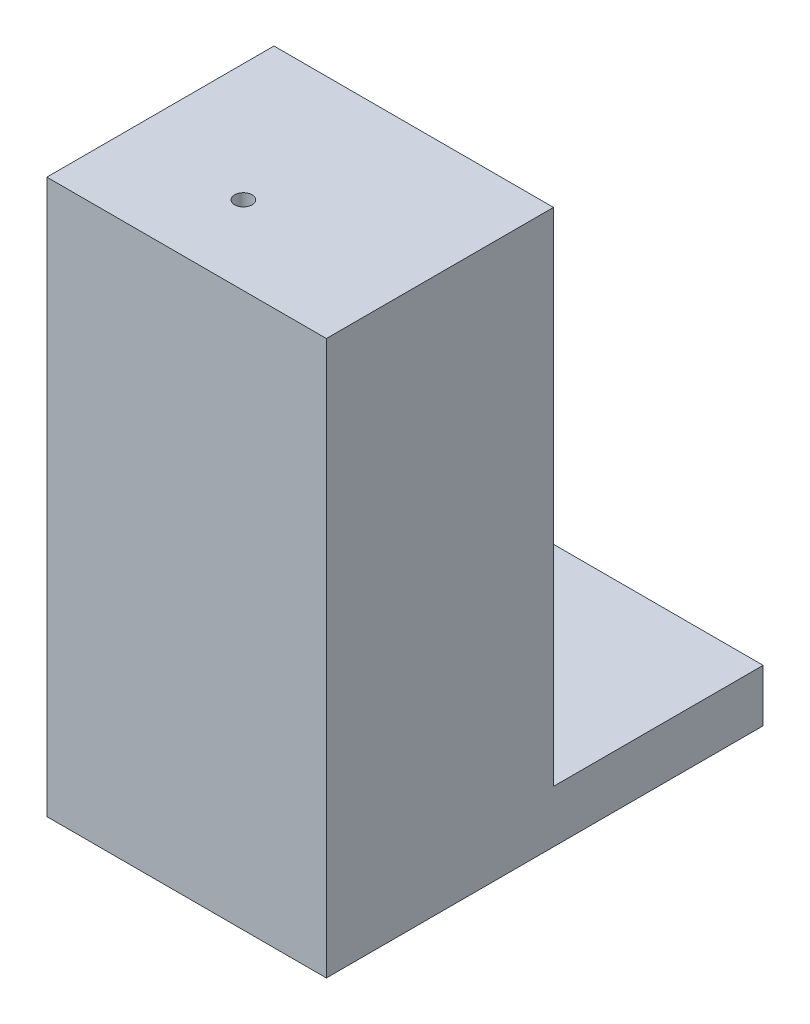
ISO-10303-21;
HEADER;
FILE_DESCRIPTION(('STEP AP214'),'2;1');
FILE_NAME('part.step','',(''),(''),'','','');
FILE_SCHEMA(('AUTOMOTIVE_DESIGN { 1 0 10303 214 1 1 1 1 }'));
ENDSEC;
DATA;
#1=APPLICATION_CONTEXT('core data for automotive mechanical design processes');
#2=APPLICATION_PROTOCOL_DEFINITION('international standard','automotive_design',2000,#1);
#3=PRODUCT_CONTEXT('',#1,'mechanical');
#4=PRODUCT('Part','Part','',(#3));
#5=PRODUCT_RELATED_PRODUCT_CATEGORY('part','',(#4));
#6=PRODUCT_DEFINITION_FORMATION('','',#4);
#7=PRODUCT_DEFINITION_CONTEXT('part definition',#1,'design');
#8=PRODUCT_DEFINITION('design','',#6,#7);
#9=PRODUCT_DEFINITION_SHAPE('','',#8);
#10=(LENGTH_UNIT() NAMED_UNIT(*) SI_UNIT(.MILLI.,.METRE.));
#11=(NAMED_UNIT(*) PLANE_ANGLE_UNIT() SI_UNIT($,.RADIAN.));
#12=(NAMED_UNIT(*) SI_UNIT($,.STERADIAN.) SOLID_ANGLE_UNIT());
#13=UNCERTAINTY_MEASURE_WITH_UNIT(LENGTH_MEASURE(1.E-05),#10,'distance_accuracy_value','');
#14=(GEOMETRIC_REPRESENTATION_CONTEXT(3) GLOBAL_UNCERTAINTY_ASSIGNED_CONTEXT((#13)) GLOBAL_UNIT_ASSIGNED_CONTEXT((#10,
#11,#12)) REPRESENTATION_CONTEXT('',''));
#15=CARTESIAN_POINT('',(0.,0.,0.));
#16=DIRECTION('',(0.,0.,1.));
#17=DIRECTION('',(1.,0.,0.));
#18=AXIS2_PLACEMENT_3D('',#15,#16,#17);
#19=CARTESIAN_POINT('',(16.,13.,-3.));
#20=DIRECTION('',(0.,0.,1.));
#21=DIRECTION('',(0.,-1.,0.));
#22=AXIS2_PLACEMENT_3D('',#19,#20,#21);
#23=PLANE('',#22);
#24=DIRECTION('',(0.,-1.,0.));
#25=VECTOR('',#24,1.);
#26=CARTESIAN_POINT('',(13.,21.7,-3.));
#27=LINE('',#26,#25);
#28=CARTESIAN_POINT('',(13.,13.,-3.));
#29=VERTEX_POINT('',#28);
#30=CARTESIAN_POINT('',(13.,3.,-3.));
#31=VERTEX_POINT('',#30);
#32=EDGE_CURVE('E190',#29,#31,#27,.T.);
#33=ORIENTED_EDGE('',*,*,#32,.T.);
#34=DIRECTION('',(-1.,0.,0.));
#35=VECTOR('',#34,1.);
#36=CARTESIAN_POINT('',(16.,3.,-3.));
#37=LINE('',#36,#35);
#38=CARTESIAN_POINT('',(0.,3.,-3.));
#39=VERTEX_POINT('',#38);
#40=EDGE_CURVE('E42',#31,#39,#37,.T.);
#41=ORIENTED_EDGE('',*,*,#40,.T.);
#42=DIRECTION('',(0.,1.,0.));
#43=VECTOR('',#42,1.);
#44=CARTESIAN_POINT('',(0.,13.,-3.));
#45=LINE('',#44,#43);
#46=CARTESIAN_POINT('',(0.,13.,-3.));
#47=VERTEX_POINT('',#46);
#48=EDGE_CURVE('E143',#39,#47,#45,.T.);
#49=ORIENTED_EDGE('',*,*,#48,.T.);
#50=DIRECTION('',(-1.,0.,0.));
#51=VECTOR('',#50,1.);
#52=CARTESIAN_POINT('',(16.,13.,-3.));
#53=LINE('',#52,#51);
#54=EDGE_CURVE('E181',#29,#47,#53,.T.);
#55=ORIENTED_EDGE('',*,*,#54,.F.);
#56=EDGE_LOOP('',(#33,#41,#49,#55));
#57=FACE_BOUND('',#56,.T.);
#58=ADVANCED_FACE('F33',(#57),#23,.F.);
#59=CARTESIAN_POINT('',(16.,13.,-5.4));
#60=DIRECTION('',(0.,1.,0.));
#61=DIRECTION('',(0.,0.,1.));
#62=AXIS2_PLACEMENT_3D('',#59,#60,#61);
#63=PLANE('',#62);
#64=DIRECTION('',(0.,0.,-1.));
#65=VECTOR('',#64,1.);
#66=CARTESIAN_POINT('',(13.,13.,-5.4));
#67=LINE('',#66,#65);
#68=CARTESIAN_POINT('',(13.,13.,-5.4));
#69=VERTEX_POINT('',#68);
#70=EDGE_CURVE('E140',#29,#69,#67,.T.);
#71=ORIENTED_EDGE('',*,*,#70,.F.);
#72=ORIENTED_EDGE('',*,*,#54,.T.);
#73=DIRECTION('',(0.,0.,-1.));
#74=VECTOR('',#73,1.);
#75=CARTESIAN_POINT('',(0.,13.,-5.4));
#76=LINE('',#75,#74);
#77=CARTESIAN_POINT('',(0.,13.,-5.4));
#78=VERTEX_POINT('',#77);
#79=EDGE_CURVE('E146',#47,#78,#76,.T.);
#80=ORIENTED_EDGE('',*,*,#79,.T.);
#81=DIRECTION('',(-1.,0.,0.));
#82=VECTOR('',#81,1.);
#83=CARTESIAN_POINT('',(16.,13.,-5.4));
#84=LINE('',#83,#82);
#85=EDGE_CURVE('E179',#69,#78,#84,.T.);
#86=ORIENTED_EDGE('',*,*,#85,.F.);
#87=EDGE_LOOP('',(#71,#72,#80,#86));
#88=FACE_BOUND('',#87,.T.);
#89=ADVANCED_FACE('F202',(#88),#63,.F.);
#90=CARTESIAN_POINT('',(16.,16.7,-5.4));
#91=DIRECTION('',(0.,0.,1.));
#92=DIRECTION('',(0.,-1.,0.));
#93=AXIS2_PLACEMENT_3D('',#90,#91,#92);
#94=PLANE('',#93);
#95=DIRECTION('',(0.,1.,0.));
#96=VECTOR('',#95,1.);
#97=CARTESIAN_POINT('',(13.,16.7,-5.4));
#98=LINE('',#97,#96);
#99=CARTESIAN_POINT('',(13.,16.7,-5.4));
#100=VERTEX_POINT('',#99);
#101=EDGE_CURVE('E244',#69,#100,#98,.T.);
#102=ORIENTED_EDGE('',*,*,#101,.F.);
#103=ORIENTED_EDGE('',*,*,#85,.T.);
#104=DIRECTION('',(0.,1.,0.));
#105=VECTOR('',#104,1.);
#106=CARTESIAN_POINT('',(0.,16.7,-5.4));
#107=LINE('',#106,#105);
#108=CARTESIAN_POINT('',(0.,16.7,-5.4));
#109=VERTEX_POINT('',#108);
#110=EDGE_CURVE('E149',#78,#109,#107,.T.);
#111=ORIENTED_EDGE('',*,*,#110,.T.);
#112=DIRECTION('',(-1.,0.,0.));
#113=VECTOR('',#112,1.);
#114=CARTESIAN_POINT('',(16.,16.7,-5.4));
#115=LINE('',#114,#113);
#116=EDGE_CURVE('E177',#100,#109,#115,.T.);
#117=ORIENTED_EDGE('',*,*,#116,.F.);
#118=EDGE_LOOP('',(#102,#103,#111,#117));
#119=FACE_BOUND('',#118,.T.);
#120=ADVANCED_FACE('F268',(#119),#94,.F.);
#121=CARTESIAN_POINT('',(16.,16.7,-3.));
#122=DIRECTION('',(0.,-1.,0.));
#123=DIRECTION('',(0.,0.,-1.));
#124=AXIS2_PLACEMENT_3D('',#121,#122,#123);
#125=PLANE('',#124);
#126=DIRECTION('',(0.,0.,1.));
#127=VECTOR('',#126,1.);
#128=CARTESIAN_POINT('',(13.,16.7,-3.));
#129=LINE('',#128,#127);
#130=CARTESIAN_POINT('',(13.,16.7,-3.));
#131=VERTEX_POINT('',#130);
#132=EDGE_CURVE('E242',#100,#131,#129,.T.);
#133=ORIENTED_EDGE('',*,*,#132,.F.);
#134=ORIENTED_EDGE('',*,*,#116,.T.);
#135=DIRECTION('',(0.,0.,1.));
#136=VECTOR('',#135,1.);
#137=CARTESIAN_POINT('',(0.,16.7,-3.));
#138=LINE('',#137,#136);
#139=CARTESIAN_POINT('',(0.,16.7,-3.));
#140=VERTEX_POINT('',#139);
#141=EDGE_CURVE('E152',#109,#140,#138,.T.);
#142=ORIENTED_EDGE('',*,*,#141,.T.);
#143=DIRECTION('',(-1.,0.,0.));
#144=VECTOR('',#143,1.);
#145=CARTESIAN_POINT('',(16.,16.7,-3.));
#146=LINE('',#145,#144);
#147=EDGE_CURVE('E175',#131,#140,#146,.T.);
#148=ORIENTED_EDGE('',*,*,#147,.F.);
#149=EDGE_LOOP('',(#133,#134,#142,#148));
#150=FACE_BOUND('',#149,.T.);
#151=ADVANCED_FACE('F264',(#150),#125,.F.);
#152=CARTESIAN_POINT('',(16.,21.7,-3.));
#153=DIRECTION('',(0.,0.,1.));
#154=DIRECTION('',(0.,-1.,0.));
#155=AXIS2_PLACEMENT_3D('',#152,#153,#154);
#156=PLANE('',#155);
#157=CARTESIAN_POINT('',(13.,21.7,-3.));
#158=VERTEX_POINT('',#157);
#159=EDGE_CURVE('E230',#158,#131,#27,.T.);
#160=ORIENTED_EDGE('',*,*,#159,.T.);
#161=ORIENTED_EDGE('',*,*,#147,.T.);
#162=DIRECTION('',(0.,1.,0.));
#163=VECTOR('',#162,1.);
#164=CARTESIAN_POINT('',(0.,21.7,-3.));
#165=LINE('',#164,#163);
#166=CARTESIAN_POINT('',(0.,21.7,-3.));
#167=VERTEX_POINT('',#166);
#168=EDGE_CURVE('E155',#140,#167,#165,.T.);
#169=ORIENTED_EDGE('',*,*,#168,.T.);
#170=DIRECTION('',(-1.,0.,0.));
#171=VECTOR('',#170,1.);
#172=CARTESIAN_POINT('',(16.,21.7,-3.));
#173=LINE('',#172,#171);
#174=EDGE_CURVE('E173',#158,#167,#173,.T.);
#175=ORIENTED_EDGE('',*,*,#174,.F.);
#176=EDGE_LOOP('',(#160,#161,#169,#175));
#177=FACE_BOUND('',#176,.T.);
#178=ADVANCED_FACE('F260',(#177),#156,.F.);
#179=CARTESIAN_POINT('',(16.,21.7,-13.));
#180=DIRECTION('',(0.,1.,0.));
#181=DIRECTION('',(0.,0.,1.));
#182=AXIS2_PLACEMENT_3D('',#179,#180,#181);
#183=PLANE('',#182);
#184=CARTESIAN_POINT('',(6.75,21.7,-4.5));
#185=DIRECTION('',(0.,1.,0.));
#186=DIRECTION('',(0.,0.,1.));
#187=AXIS2_PLACEMENT_3D('',#184,#185,#186);
#188=CIRCLE('',#187,0.500000000000001);
#189=CARTESIAN_POINT('',(6.75,21.7,-4.));
#190=VERTEX_POINT('',#189);
#191=EDGE_CURVE('E322',#190,#190,#188,.F.);
#192=ORIENTED_EDGE('',*,*,#191,.F.);
#193=EDGE_LOOP('',(#192));
#194=FACE_BOUND('',#193,.T.);
#195=DIRECTION('',(0.,0.,1.));
#196=VECTOR('',#195,1.);
#197=CARTESIAN_POINT('',(13.,21.7,-3.));
#198=LINE('',#197,#196);
#199=CARTESIAN_POINT('',(13.,21.7,-13.));
#200=VERTEX_POINT('',#199);
#201=EDGE_CURVE('E232',#200,#158,#198,.T.);
#202=ORIENTED_EDGE('',*,*,#201,.T.);
#203=ORIENTED_EDGE('',*,*,#174,.T.);
#204=DIRECTION('',(0.,0.,-1.));
#205=VECTOR('',#204,1.);
#206=CARTESIAN_POINT('',(0.,21.7,-13.));
#207=LINE('',#206,#205);
#208=CARTESIAN_POINT('',(0.,21.7,-13.));
#209=VERTEX_POINT('',#208);
#210=EDGE_CURVE('E158',#167,#209,#207,.T.);
#211=ORIENTED_EDGE('',*,*,#210,.T.);
#212=DIRECTION('',(-1.,0.,0.));
#213=VECTOR('',#212,1.);
#214=CARTESIAN_POINT('',(16.,21.7,-13.));
#215=LINE('',#214,#213);
#216=EDGE_CURVE('E171',#200,#209,#215,.T.);
#217=ORIENTED_EDGE('',*,*,#216,.F.);
#218=EDGE_LOOP('',(#202,#203,#211,#217));
#219=FACE_BOUND('',#218,.T.);
#220=ADVANCED_FACE('F256',(#194,#219),#183,.F.);
#221=CARTESIAN_POINT('',(16.,3.,-25.));
#222=DIRECTION('',(0.,0.,1.));
#223=DIRECTION('',(1.,0.,0.));
#224=AXIS2_PLACEMENT_3D('',#221,#222,#223);
#225=PLANE('',#224);
#226=DIRECTION('',(0.,1.,0.));
#227=VECTOR('',#226,1.);
#228=CARTESIAN_POINT('',(0.,3.,-25.));
#229=LINE('',#228,#227);
#230=CARTESIAN_POINT('',(0.,0.,-25.));
#231=VERTEX_POINT('',#230);
#232=CARTESIAN_POINT('',(0.,3.,-25.));
#233=VERTEX_POINT('',#232);
#234=EDGE_CURVE('E136',#231,#233,#229,.T.);
#235=ORIENTED_EDGE('',*,*,#234,.T.);
#236=DIRECTION('',(-1.,0.,0.));
#237=VECTOR('',#236,1.);
#238=CARTESIAN_POINT('',(16.,3.,-25.));
#239=LINE('',#238,#237);
#240=CARTESIAN_POINT('',(16.,3.,-25.));
#241=VERTEX_POINT('',#240);
#242=EDGE_CURVE('E11',#241,#233,#239,.T.);
#243=ORIENTED_EDGE('',*,*,#242,.F.);
#244=DIRECTION('',(0.,1.,0.));
#245=VECTOR('',#244,1.);
#246=CARTESIAN_POINT('',(16.,3.,-25.));
#247=LINE('',#246,#245);
#248=CARTESIAN_POINT('',(16.,0.,-25.));
#249=VERTEX_POINT('',#248);
#250=EDGE_CURVE('E167',#249,#241,#247,.T.);
#251=ORIENTED_EDGE('',*,*,#250,.F.);
#252=DIRECTION('',(-1.,0.,0.));
#253=VECTOR('',#252,1.);
#254=CARTESIAN_POINT('',(16.,0.,-25.));
#255=LINE('',#254,#253);
#256=EDGE_CURVE('E132',#249,#231,#255,.T.);
#257=ORIENTED_EDGE('',*,*,#256,.T.);
#258=EDGE_LOOP('',(#235,#243,#251,#257));
#259=FACE_BOUND('',#258,.T.);
#260=ADVANCED_FACE('F35',(#259),#225,.F.);
#261=CARTESIAN_POINT('',(16.,3.,-3.));
#262=DIRECTION('',(0.,-1.,0.));
#263=DIRECTION('',(0.,0.,-1.));
#264=AXIS2_PLACEMENT_3D('',#261,#262,#263);
#265=PLANE('',#264);
#266=DIRECTION('',(0.,0.,-1.));
#267=VECTOR('',#266,1.);
#268=CARTESIAN_POINT('',(13.,3.,-3.));
#269=LINE('',#268,#267);
#270=CARTESIAN_POINT('',(13.,3.,-13.));
#271=VERTEX_POINT('',#270);
#272=EDGE_CURVE('E226',#31,#271,#269,.T.);
#273=ORIENTED_EDGE('',*,*,#272,.T.);
#274=DIRECTION('',(1.,0.,0.));
#275=VECTOR('',#274,1.);
#276=CARTESIAN_POINT('',(13.,3.,-13.));
#277=LINE('',#276,#275);
#278=CARTESIAN_POINT('',(16.,3.,-13.));
#279=VERTEX_POINT('',#278);
#280=EDGE_CURVE('E240',#271,#279,#277,.T.);
#281=ORIENTED_EDGE('',*,*,#280,.T.);
#282=DIRECTION('',(0.,0.,1.));
#283=VECTOR('',#282,1.);
#284=CARTESIAN_POINT('',(16.,3.,-3.));
#285=LINE('',#284,#283);
#286=EDGE_CURVE('E106',#241,#279,#285,.T.);
#287=ORIENTED_EDGE('',*,*,#286,.F.);
#288=ORIENTED_EDGE('',*,*,#242,.T.);
#289=DIRECTION('',(0.,0.,1.));
#290=VECTOR('',#289,1.);
#291=CARTESIAN_POINT('',(0.,3.,-3.));
#292=LINE('',#291,#290);
#293=EDGE_CURVE('E139',#233,#39,#292,.T.);
#294=ORIENTED_EDGE('',*,*,#293,.T.);
#295=ORIENTED_EDGE('',*,*,#40,.F.);
#296=EDGE_LOOP('',(#273,#281,#287,#288,#294,#295));
#297=FACE_BOUND('',#296,.T.);
#298=ADVANCED_FACE('F192',(#297),#265,.F.);
#299=CARTESIAN_POINT('',(16.,31.7,-13.));
#300=DIRECTION('',(0.,0.,1.));
#301=DIRECTION('',(0.,-1.,0.));
#302=AXIS2_PLACEMENT_3D('',#299,#300,#301);
#303=PLANE('',#302);
#304=DIRECTION('',(0.,1.,0.));
#305=VECTOR('',#304,1.);
#306=CARTESIAN_POINT('',(0.,31.7,-13.));
#307=LINE('',#306,#305);
#308=CARTESIAN_POINT('',(0.,31.7,-13.));
#309=VERTEX_POINT('',#308);
#310=EDGE_CURVE('E161',#209,#309,#307,.T.);
#311=ORIENTED_EDGE('',*,*,#310,.T.);
#312=DIRECTION('',(-1.,0.,0.));
#313=VECTOR('',#312,1.);
#314=CARTESIAN_POINT('',(16.,31.7,-13.));
#315=LINE('',#314,#313);
#316=CARTESIAN_POINT('',(16.,31.7,-13.));
#317=VERTEX_POINT('',#316);
#318=EDGE_CURVE('E127',#317,#309,#315,.T.);
#319=ORIENTED_EDGE('',*,*,#318,.F.);
#320=DIRECTION('',(0.,1.,0.));
#321=VECTOR('',#320,1.);
#322=CARTESIAN_POINT('',(16.,31.7,-13.));
#323=LINE('',#322,#321);
#324=EDGE_CURVE('E119',#279,#317,#323,.T.);
#325=ORIENTED_EDGE('',*,*,#324,.F.);
#326=ORIENTED_EDGE('',*,*,#280,.F.);
#327=DIRECTION('',(0.,1.,0.));
#328=VECTOR('',#327,1.);
#329=CARTESIAN_POINT('',(13.,21.7,-13.));
#330=LINE('',#329,#328);
#331=EDGE_CURVE('E229',#271,#200,#330,.T.);
#332=ORIENTED_EDGE('',*,*,#331,.T.);
#333=ORIENTED_EDGE('',*,*,#216,.T.);
#334=EDGE_LOOP('',(#311,#319,#325,#326,#332,#333));
#335=FACE_BOUND('',#334,.T.);
#336=ADVANCED_FACE('F253',(#335),#303,.F.);
#337=CARTESIAN_POINT('',(16.,31.7,0.));
#338=DIRECTION('',(0.,-1.,0.));
#339=DIRECTION('',(0.,0.,-1.));
#340=AXIS2_PLACEMENT_3D('',#337,#338,#339);
#341=PLANE('',#340);
#342=CARTESIAN_POINT('',(6.75,31.7,-4.5));
#343=DIRECTION('',(0.,1.,0.));
#344=DIRECTION('',(0.,0.,1.));
#345=AXIS2_PLACEMENT_3D('',#342,#343,#344);
#346=CIRCLE('',#345,0.500000000000001);
#347=CARTESIAN_POINT('',(6.75,31.7,-4.));
#348=VERTEX_POINT('',#347);
#349=EDGE_CURVE('E320',#348,#348,#346,.T.);
#350=ORIENTED_EDGE('',*,*,#349,.F.);
#351=EDGE_LOOP('',(#350));
#352=FACE_BOUND('',#351,.T.);
#353=DIRECTION('',(0.,0.,1.));
#354=VECTOR('',#353,1.);
#355=CARTESIAN_POINT('',(0.,31.7,0.));
#356=LINE('',#355,#354);
#357=CARTESIAN_POINT('',(0.,31.7,0.));
#358=VERTEX_POINT('',#357);
#359=EDGE_CURVE('E126',#309,#358,#356,.T.);
#360=ORIENTED_EDGE('',*,*,#359,.T.);
#361=DIRECTION('',(-1.,0.,0.));
#362=VECTOR('',#361,1.);
#363=CARTESIAN_POINT('',(16.,31.7,0.));
#364=LINE('',#363,#362);
#365=CARTESIAN_POINT('',(16.,31.7,0.));
#366=VERTEX_POINT('',#365);
#367=EDGE_CURVE('E124',#366,#358,#364,.T.);
#368=ORIENTED_EDGE('',*,*,#367,.F.);
#369=DIRECTION('',(0.,0.,1.));
#370=VECTOR('',#369,1.);
#371=CARTESIAN_POINT('',(16.,31.7,-5.03499999999996));
#372=LINE('',#371,#370);
#373=EDGE_CURVE('E113',#317,#366,#372,.T.);
#374=ORIENTED_EDGE('',*,*,#373,.F.);
#375=ORIENTED_EDGE('',*,*,#318,.T.);
#376=EDGE_LOOP('',(#360,#368,#374,#375));
#377=FACE_BOUND('',#376,.T.);
#378=ADVANCED_FACE('F125',(#352,#377),#341,.F.);
#379=CARTESIAN_POINT('',(16.,0.,0.));
#380=DIRECTION('',(0.,0.,-1.));
#381=DIRECTION('',(-1.,0.,0.));
#382=AXIS2_PLACEMENT_3D('',#379,#380,#381);
#383=PLANE('',#382);
#384=DIRECTION('',(0.,-1.,0.));
#385=VECTOR('',#384,1.);
#386=CARTESIAN_POINT('',(0.,0.,0.));
#387=LINE('',#386,#385);
#388=CARTESIAN_POINT('',(0.,0.,0.));
#389=VERTEX_POINT('',#388);
#390=EDGE_CURVE('E92',#358,#389,#387,.T.);
#391=ORIENTED_EDGE('',*,*,#390,.T.);
#392=DIRECTION('',(-1.,0.,0.));
#393=VECTOR('',#392,1.);
#394=CARTESIAN_POINT('',(16.,0.,0.));
#395=LINE('',#394,#393);
#396=CARTESIAN_POINT('',(16.,0.,0.));
#397=VERTEX_POINT('',#396);
#398=EDGE_CURVE('E128',#397,#389,#395,.T.);
#399=ORIENTED_EDGE('',*,*,#398,.F.);
#400=DIRECTION('',(0.,-1.,0.));
#401=VECTOR('',#400,1.);
#402=CARTESIAN_POINT('',(16.,0.,0.));
#403=LINE('',#402,#401);
#404=EDGE_CURVE('E117',#366,#397,#403,.T.);
#405=ORIENTED_EDGE('',*,*,#404,.F.);
#406=ORIENTED_EDGE('',*,*,#367,.T.);
#407=EDGE_LOOP('',(#391,#399,#405,#406));
#408=FACE_BOUND('',#407,.T.);
#409=ADVANCED_FACE('F130',(#408),#383,.F.);
#410=CARTESIAN_POINT('',(16.,0.,-25.));
#411=DIRECTION('',(0.,1.,0.));
#412=DIRECTION('',(0.,0.,1.));
#413=AXIS2_PLACEMENT_3D('',#410,#411,#412);
#414=PLANE('',#413);
#415=DIRECTION('',(0.,0.,-1.));
#416=VECTOR('',#415,1.);
#417=CARTESIAN_POINT('',(0.,0.,-25.));
#418=LINE('',#417,#416);
#419=EDGE_CURVE('E98',#389,#231,#418,.T.);
#420=ORIENTED_EDGE('',*,*,#419,.T.);
#421=ORIENTED_EDGE('',*,*,#256,.F.);
#422=DIRECTION('',(0.,0.,-1.));
#423=VECTOR('',#422,1.);
#424=CARTESIAN_POINT('',(16.,0.,-25.));
#425=LINE('',#424,#423);
#426=EDGE_CURVE('E50',#397,#249,#425,.T.);
#427=ORIENTED_EDGE('',*,*,#426,.F.);
#428=ORIENTED_EDGE('',*,*,#398,.T.);
#429=EDGE_LOOP('',(#420,#421,#427,#428));
#430=FACE_BOUND('',#429,.T.);
#431=ADVANCED_FACE('F303',(#430),#414,.F.);
#432=CARTESIAN_POINT('',(16.,0.,0.));
#433=DIRECTION('',(-1.,0.,0.));
#434=DIRECTION('',(0.,0.,1.));
#435=AXIS2_PLACEMENT_3D('',#432,#433,#434);
#436=PLANE('',#435);
#437=ORIENTED_EDGE('',*,*,#286,.T.);
#438=ORIENTED_EDGE('',*,*,#324,.T.);
#439=ORIENTED_EDGE('',*,*,#373,.T.);
#440=ORIENTED_EDGE('',*,*,#404,.T.);
#441=ORIENTED_EDGE('',*,*,#426,.T.);
#442=ORIENTED_EDGE('',*,*,#250,.T.);
#443=EDGE_LOOP('',(#437,#438,#439,#440,#441,#442));
#444=FACE_BOUND('',#443,.T.);
#445=ADVANCED_FACE('F115',(#444),#436,.F.);
#446=CARTESIAN_POINT('',(0.,0.,0.));
#447=DIRECTION('',(-1.,0.,0.));
#448=DIRECTION('',(0.,0.,1.));
#449=AXIS2_PLACEMENT_3D('',#446,#447,#448);
#450=PLANE('',#449);
#451=ORIENTED_EDGE('',*,*,#234,.F.);
#452=ORIENTED_EDGE('',*,*,#419,.F.);
#453=ORIENTED_EDGE('',*,*,#390,.F.);
#454=ORIENTED_EDGE('',*,*,#359,.F.);
#455=ORIENTED_EDGE('',*,*,#310,.F.);
#456=ORIENTED_EDGE('',*,*,#210,.F.);
#457=ORIENTED_EDGE('',*,*,#168,.F.);
#458=ORIENTED_EDGE('',*,*,#141,.F.);
#459=ORIENTED_EDGE('',*,*,#110,.F.);
#460=ORIENTED_EDGE('',*,*,#79,.F.);
#461=ORIENTED_EDGE('',*,*,#48,.F.);
#462=ORIENTED_EDGE('',*,*,#293,.F.);
#463=EDGE_LOOP('',(#451,#452,#453,#454,#455,#456,#457,#458,#459,#460,#461,#462));
#464=FACE_BOUND('',#463,.T.);
#465=ADVANCED_FACE('F196',(#464),#450,.T.);
#466=CARTESIAN_POINT('',(13.,0.,0.));
#467=DIRECTION('',(1.,0.,0.));
#468=DIRECTION('',(0.,0.,-1.));
#469=AXIS2_PLACEMENT_3D('',#466,#467,#468);
#470=PLANE('',#469);
#471=ORIENTED_EDGE('',*,*,#32,.F.);
#472=ORIENTED_EDGE('',*,*,#70,.T.);
#473=ORIENTED_EDGE('',*,*,#101,.T.);
#474=ORIENTED_EDGE('',*,*,#132,.T.);
#475=ORIENTED_EDGE('',*,*,#159,.F.);
#476=ORIENTED_EDGE('',*,*,#201,.F.);
#477=ORIENTED_EDGE('',*,*,#331,.F.);
#478=ORIENTED_EDGE('',*,*,#272,.F.);
#479=EDGE_LOOP('',(#471,#472,#473,#474,#475,#476,#477,#478));
#480=FACE_BOUND('',#479,.T.);
#481=ADVANCED_FACE('F227',(#480),#470,.F.);
#482=CARTESIAN_POINT('',(6.75,-0.001000000000001,-4.5));
#483=DIRECTION('',(0.,1.,0.));
#484=DIRECTION('',(0.,0.,1.));
#485=AXIS2_PLACEMENT_3D('',#482,#483,#484);
#486=CYLINDRICAL_SURFACE('',#485,0.500000000000001);
#487=ORIENTED_EDGE('',*,*,#349,.T.);
#488=EDGE_LOOP('',(#487));
#489=FACE_BOUND('',#488,.T.);
#490=ORIENTED_EDGE('',*,*,#191,.T.);
#491=EDGE_LOOP('',(#490));
#492=FACE_BOUND('',#491,.T.);
#493=ADVANCED_FACE('F312',(#489,#492),#486,.F.);
#494=CLOSED_SHELL('',(#58,#89,#120,#151,#178,#220,#260,#298,#336,#378,#409,#431,#445,#465,#481,#493));
#495=MANIFOLD_SOLID_BREP('B2',#494);
#496=ADVANCED_BREP_SHAPE_REPRESENTATION('',(#18,#495),#14);
#497=SHAPE_DEFINITION_REPRESENTATION(#9,#496);
ENDSEC;
END-ISO-10303-21;
